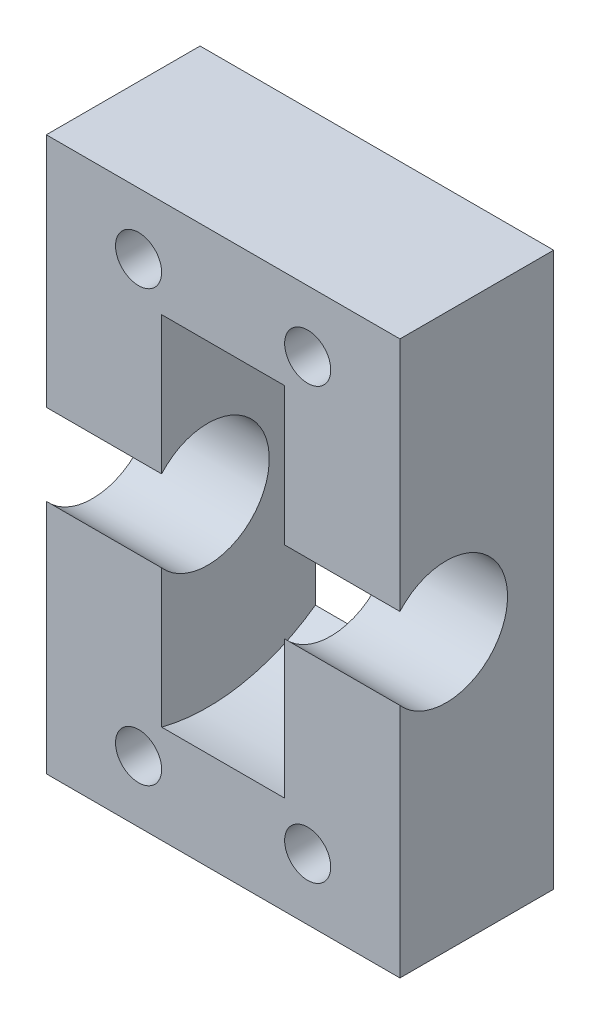
ISO-10303-21;
HEADER;
FILE_DESCRIPTION(('STEP AP214'),'2;1');
FILE_NAME('part.step','',(''),(''),'','','');
FILE_SCHEMA(('AUTOMOTIVE_DESIGN { 1 0 10303 214 1 1 1 1 }'));
ENDSEC;
DATA;
#1=APPLICATION_CONTEXT('core data for automotive mechanical design processes');
#2=APPLICATION_PROTOCOL_DEFINITION('international standard','automotive_design',2000,#1);
#3=PRODUCT_CONTEXT('',#1,'mechanical');
#4=PRODUCT('Part','Part','',(#3));
#5=PRODUCT_RELATED_PRODUCT_CATEGORY('part','',(#4));
#6=PRODUCT_DEFINITION_FORMATION('','',#4);
#7=PRODUCT_DEFINITION_CONTEXT('part definition',#1,'design');
#8=PRODUCT_DEFINITION('design','',#6,#7);
#9=PRODUCT_DEFINITION_SHAPE('','',#8);
#10=(LENGTH_UNIT() NAMED_UNIT(*) SI_UNIT(.MILLI.,.METRE.));
#11=(NAMED_UNIT(*) PLANE_ANGLE_UNIT() SI_UNIT($,.RADIAN.));
#12=(NAMED_UNIT(*) SI_UNIT($,.STERADIAN.) SOLID_ANGLE_UNIT());
#13=UNCERTAINTY_MEASURE_WITH_UNIT(LENGTH_MEASURE(1.E-05),#10,'distance_accuracy_value','');
#14=(GEOMETRIC_REPRESENTATION_CONTEXT(3) GLOBAL_UNCERTAINTY_ASSIGNED_CONTEXT((#13)) GLOBAL_UNIT_ASSIGNED_CONTEXT((#10,
#11,#12)) REPRESENTATION_CONTEXT('',''));
#15=CARTESIAN_POINT('',(0.,0.,0.));
#16=DIRECTION('',(0.,0.,1.));
#17=DIRECTION('',(1.,0.,0.));
#18=AXIS2_PLACEMENT_3D('',#15,#16,#17);
#19=CARTESIAN_POINT('',(23.,17.9999999999999,7.));
#20=DIRECTION('',(-1.,0.,0.));
#21=DIRECTION('',(0.,0.,1.));
#22=AXIS2_PLACEMENT_3D('',#19,#20,#21);
#23=CYLINDRICAL_SURFACE('',#22,4.);
#24=DIRECTION('',(-1.,0.,0.));
#25=VECTOR('',#24,1.);
#26=CARTESIAN_POINT('',(0.,20.6457513110646,9.99999999999999));
#27=LINE('',#26,#25);
#28=CARTESIAN_POINT('',(7.50000000000001,20.6457513110645,9.99999999999999));
#29=VERTEX_POINT('',#28);
#30=CARTESIAN_POINT('',(0.,20.6457513110645,9.99999999999999));
#31=VERTEX_POINT('',#30);
#32=EDGE_CURVE('E140',#29,#31,#27,.T.);
#33=ORIENTED_EDGE('',*,*,#32,.T.);
#34=CARTESIAN_POINT('',(0.,17.9999999999999,7.));
#35=DIRECTION('',(-1.,0.,0.));
#36=DIRECTION('',(0.,0.,1.));
#37=AXIS2_PLACEMENT_3D('',#34,#35,#36);
#38=CIRCLE('',#37,4.);
#39=CARTESIAN_POINT('',(0.,15.3542486889353,9.99999999999999));
#40=VERTEX_POINT('',#39);
#41=EDGE_CURVE('E199',#31,#40,#38,.T.);
#42=ORIENTED_EDGE('',*,*,#41,.T.);
#43=DIRECTION('',(-1.,0.,0.));
#44=VECTOR('',#43,1.);
#45=CARTESIAN_POINT('',(0.,15.3542486889353,9.99999999999999));
#46=LINE('',#45,#44);
#47=CARTESIAN_POINT('',(7.50000000000001,15.3542486889353,9.99999999999999));
#48=VERTEX_POINT('',#47);
#49=EDGE_CURVE('E123',#40,#48,#46,.F.);
#50=ORIENTED_EDGE('',*,*,#49,.T.);
#51=CARTESIAN_POINT('',(7.50000000000001,17.9999999999999,7.));
#52=DIRECTION('',(-1.,0.,0.));
#53=DIRECTION('',(0.,0.,1.));
#54=AXIS2_PLACEMENT_3D('',#51,#52,#53);
#55=CIRCLE('',#54,4.);
#56=EDGE_CURVE('E205',#29,#48,#55,.T.);
#57=ORIENTED_EDGE('',*,*,#56,.F.);
#58=EDGE_LOOP('',(#33,#42,#50,#57));
#59=FACE_BOUND('',#58,.T.);
#60=ADVANCED_FACE('F16',(#59),#23,.F.);
#61=CARTESIAN_POINT('',(23.,17.9999999999999,7.));
#62=DIRECTION('',(-1.,0.,0.));
#63=DIRECTION('',(0.,0.,1.));
#64=AXIS2_PLACEMENT_3D('',#61,#62,#63);
#65=CYLINDRICAL_SURFACE('',#64,4.);
#66=CARTESIAN_POINT('',(15.5,17.9999999999999,7.));
#67=DIRECTION('',(-1.,0.,0.));
#68=DIRECTION('',(0.,0.,1.));
#69=AXIS2_PLACEMENT_3D('',#66,#67,#68);
#70=CIRCLE('',#69,4.);
#71=CARTESIAN_POINT('',(15.5,20.6457513110645,9.99999999999999));
#72=VERTEX_POINT('',#71);
#73=CARTESIAN_POINT('',(15.5,15.3542486889353,9.99999999999999));
#74=VERTEX_POINT('',#73);
#75=EDGE_CURVE('E106',#72,#74,#70,.T.);
#76=ORIENTED_EDGE('',*,*,#75,.T.);
#77=DIRECTION('',(-1.,0.,0.));
#78=VECTOR('',#77,1.);
#79=CARTESIAN_POINT('',(0.,15.3542486889353,9.99999999999999));
#80=LINE('',#79,#78);
#81=CARTESIAN_POINT('',(23.,15.3542486889353,9.99999999999999));
#82=VERTEX_POINT('',#81);
#83=EDGE_CURVE('E109',#74,#82,#80,.F.);
#84=ORIENTED_EDGE('',*,*,#83,.T.);
#85=CARTESIAN_POINT('',(23.,17.9999999999999,7.));
#86=DIRECTION('',(-1.,0.,0.));
#87=DIRECTION('',(0.,0.,1.));
#88=AXIS2_PLACEMENT_3D('',#85,#86,#87);
#89=CIRCLE('',#88,4.);
#90=CARTESIAN_POINT('',(23.,20.6457513110645,9.99999999999999));
#91=VERTEX_POINT('',#90);
#92=EDGE_CURVE('E197',#82,#91,#89,.F.);
#93=ORIENTED_EDGE('',*,*,#92,.T.);
#94=DIRECTION('',(-1.,0.,0.));
#95=VECTOR('',#94,1.);
#96=CARTESIAN_POINT('',(0.,20.6457513110645,9.99999999999999));
#97=LINE('',#96,#95);
#98=EDGE_CURVE('E103',#91,#72,#97,.T.);
#99=ORIENTED_EDGE('',*,*,#98,.T.);
#100=EDGE_LOOP('',(#76,#84,#93,#99));
#101=FACE_BOUND('',#100,.T.);
#102=ADVANCED_FACE('F108',(#101),#65,.F.);
#103=CARTESIAN_POINT('',(0.,35.9999999999999,9.99999999999999));
#104=DIRECTION('',(0.,0.,-1.));
#105=DIRECTION('',(-1.,0.,0.));
#106=AXIS2_PLACEMENT_3D('',#103,#104,#105);
#107=PLANE('',#106);
#108=DIRECTION('',(0.,1.,0.));
#109=VECTOR('',#108,1.);
#110=CARTESIAN_POINT('',(15.5,17.9999999999998,10.));
#111=LINE('',#110,#109);
#112=CARTESIAN_POINT('',(15.5000000000001,29.618950038622,9.99999999999999));
#113=VERTEX_POINT('',#112);
#114=EDGE_CURVE('E114',#113,#72,#111,.F.);
#115=ORIENTED_EDGE('',*,*,#114,.T.);
#116=ORIENTED_EDGE('',*,*,#98,.F.);
#117=DIRECTION('',(0.,1.,0.));
#118=VECTOR('',#117,1.);
#119=CARTESIAN_POINT('',(23.,0.,9.99999999999999));
#120=LINE('',#119,#118);
#121=CARTESIAN_POINT('',(23.,35.9999999999999,10.));
#122=VERTEX_POINT('',#121);
#123=EDGE_CURVE('E176',#91,#122,#120,.T.);
#124=ORIENTED_EDGE('',*,*,#123,.T.);
#125=DIRECTION('',(1.,0.,0.));
#126=VECTOR('',#125,1.);
#127=CARTESIAN_POINT('',(0.,35.9999999999999,10.));
#128=LINE('',#127,#126);
#129=CARTESIAN_POINT('',(0.,35.9999999999999,9.99999999999999));
#130=VERTEX_POINT('',#129);
#131=EDGE_CURVE('E155',#122,#130,#128,.F.);
#132=ORIENTED_EDGE('',*,*,#131,.T.);
#133=DIRECTION('',(0.,1.,0.));
#134=VECTOR('',#133,1.);
#135=CARTESIAN_POINT('',(0.,0.,9.99999999999999));
#136=LINE('',#135,#134);
#137=EDGE_CURVE('E182',#130,#31,#136,.F.);
#138=ORIENTED_EDGE('',*,*,#137,.T.);
#139=ORIENTED_EDGE('',*,*,#32,.F.);
#140=DIRECTION('',(0.,1.,0.));
#141=VECTOR('',#140,1.);
#142=CARTESIAN_POINT('',(7.50000000000001,17.9999999999999,10.));
#143=LINE('',#142,#141);
#144=CARTESIAN_POINT('',(7.50000000000001,29.618950038622,9.99999999999997));
#145=VERTEX_POINT('',#144);
#146=EDGE_CURVE('E208',#145,#29,#143,.F.);
#147=ORIENTED_EDGE('',*,*,#146,.F.);
#148=DIRECTION('',(-1.,0.,0.));
#149=VECTOR('',#148,1.);
#150=CARTESIAN_POINT('',(15.5,29.618950038622,9.99999999999994));
#151=LINE('',#150,#149);
#152=EDGE_CURVE('E131',#145,#113,#151,.F.);
#153=ORIENTED_EDGE('',*,*,#152,.T.);
#154=EDGE_LOOP('',(#115,#116,#124,#132,#138,#139,#147,#153));
#155=FACE_BOUND('',#154,.T.);
#156=CARTESIAN_POINT('',(5.99999999999998,32.,10.));
#157=DIRECTION('',(0.,0.,1.));
#158=DIRECTION('',(1.,0.,0.));
#159=AXIS2_PLACEMENT_3D('',#156,#157,#158);
#160=CIRCLE('',#159,1.5);
#161=CARTESIAN_POINT('',(7.49999999999998,32.,10.));
#162=VERTEX_POINT('',#161);
#163=EDGE_CURVE('E138',#162,#162,#160,.F.);
#164=ORIENTED_EDGE('',*,*,#163,.T.);
#165=EDGE_LOOP('',(#164));
#166=FACE_BOUND('',#165,.T.);
#167=CARTESIAN_POINT('',(17.,32.,10.));
#168=DIRECTION('',(0.,0.,1.));
#169=DIRECTION('',(1.,0.,0.));
#170=AXIS2_PLACEMENT_3D('',#167,#168,#169);
#171=CIRCLE('',#170,1.5);
#172=CARTESIAN_POINT('',(18.5,32.,10.));
#173=VERTEX_POINT('',#172);
#174=EDGE_CURVE('E213',#173,#173,#171,.F.);
#175=ORIENTED_EDGE('',*,*,#174,.T.);
#176=EDGE_LOOP('',(#175));
#177=FACE_BOUND('',#176,.T.);
#178=ADVANCED_FACE('F280',(#155,#166,#177),#107,.F.);
#179=CARTESIAN_POINT('',(0.,35.9999999999999,9.99999999999999));
#180=DIRECTION('',(0.,0.,-1.));
#181=DIRECTION('',(-1.,0.,0.));
#182=AXIS2_PLACEMENT_3D('',#179,#180,#181);
#183=PLANE('',#182);
#184=DIRECTION('',(0.,1.,0.));
#185=VECTOR('',#184,1.);
#186=CARTESIAN_POINT('',(15.5,17.9999999999998,9.99999999999999));
#187=LINE('',#186,#185);
#188=CARTESIAN_POINT('',(15.5,6.38104996137751,10.));
#189=VERTEX_POINT('',#188);
#190=EDGE_CURVE('E113',#74,#189,#187,.F.);
#191=ORIENTED_EDGE('',*,*,#190,.T.);
#192=DIRECTION('',(-1.,0.,0.));
#193=VECTOR('',#192,1.);
#194=CARTESIAN_POINT('',(15.5,6.38104996137752,10.));
#195=LINE('',#194,#193);
#196=CARTESIAN_POINT('',(7.50000000000001,6.38104996137751,10.));
#197=VERTEX_POINT('',#196);
#198=EDGE_CURVE('E180',#189,#197,#195,.T.);
#199=ORIENTED_EDGE('',*,*,#198,.T.);
#200=DIRECTION('',(0.,1.,0.));
#201=VECTOR('',#200,1.);
#202=CARTESIAN_POINT('',(7.50000000000001,17.9999999999999,9.99999999999999));
#203=LINE('',#202,#201);
#204=EDGE_CURVE('E204',#48,#197,#203,.F.);
#205=ORIENTED_EDGE('',*,*,#204,.F.);
#206=ORIENTED_EDGE('',*,*,#49,.F.);
#207=DIRECTION('',(0.,1.,0.));
#208=VECTOR('',#207,1.);
#209=CARTESIAN_POINT('',(0.,0.,10.));
#210=LINE('',#209,#208);
#211=CARTESIAN_POINT('',(0.,0.,10.));
#212=VERTEX_POINT('',#211);
#213=EDGE_CURVE('E157',#40,#212,#210,.F.);
#214=ORIENTED_EDGE('',*,*,#213,.T.);
#215=DIRECTION('',(-1.,0.,0.));
#216=VECTOR('',#215,1.);
#217=CARTESIAN_POINT('',(0.,0.,10.));
#218=LINE('',#217,#216);
#219=CARTESIAN_POINT('',(23.,0.,10.));
#220=VERTEX_POINT('',#219);
#221=EDGE_CURVE('E146',#212,#220,#218,.F.);
#222=ORIENTED_EDGE('',*,*,#221,.T.);
#223=DIRECTION('',(0.,1.,0.));
#224=VECTOR('',#223,1.);
#225=CARTESIAN_POINT('',(23.,0.,10.));
#226=LINE('',#225,#224);
#227=EDGE_CURVE('E121',#220,#82,#226,.T.);
#228=ORIENTED_EDGE('',*,*,#227,.T.);
#229=ORIENTED_EDGE('',*,*,#83,.F.);
#230=EDGE_LOOP('',(#191,#199,#205,#206,#214,#222,#228,#229));
#231=FACE_BOUND('',#230,.T.);
#232=CARTESIAN_POINT('',(17.,4.,10.));
#233=DIRECTION('',(0.,0.,1.));
#234=DIRECTION('',(1.,0.,0.));
#235=AXIS2_PLACEMENT_3D('',#232,#233,#234);
#236=CIRCLE('',#235,1.5);
#237=CARTESIAN_POINT('',(18.5,4.,10.));
#238=VERTEX_POINT('',#237);
#239=EDGE_CURVE('E215',#238,#238,#236,.F.);
#240=ORIENTED_EDGE('',*,*,#239,.T.);
#241=EDGE_LOOP('',(#240));
#242=FACE_BOUND('',#241,.T.);
#243=CARTESIAN_POINT('',(6.00000000000001,4.,10.));
#244=DIRECTION('',(0.,0.,1.));
#245=DIRECTION('',(1.,0.,0.));
#246=AXIS2_PLACEMENT_3D('',#243,#244,#245);
#247=CIRCLE('',#246,1.5);
#248=CARTESIAN_POINT('',(7.50000000000001,4.,10.));
#249=VERTEX_POINT('',#248);
#250=EDGE_CURVE('E19',#249,#249,#247,.F.);
#251=ORIENTED_EDGE('',*,*,#250,.T.);
#252=EDGE_LOOP('',(#251));
#253=FACE_BOUND('',#252,.T.);
#254=ADVANCED_FACE('F117',(#231,#242,#253),#183,.F.);
#255=CARTESIAN_POINT('',(6.00000000000001,4.,0.));
#256=DIRECTION('',(0.,0.,1.));
#257=DIRECTION('',(1.,0.,0.));
#258=AXIS2_PLACEMENT_3D('',#255,#256,#257);
#259=CYLINDRICAL_SURFACE('',#258,1.5);
#260=ORIENTED_EDGE('',*,*,#250,.F.);
#261=EDGE_LOOP('',(#260));
#262=FACE_BOUND('',#261,.T.);
#263=CARTESIAN_POINT('',(6.00000000000001,4.,0.));
#264=DIRECTION('',(0.,0.,1.));
#265=DIRECTION('',(1.,0.,0.));
#266=AXIS2_PLACEMENT_3D('',#263,#264,#265);
#267=CIRCLE('',#266,1.5);
#268=CARTESIAN_POINT('',(7.50000000000001,4.,0.));
#269=VERTEX_POINT('',#268);
#270=EDGE_CURVE('E152',#269,#269,#267,.T.);
#271=ORIENTED_EDGE('',*,*,#270,.F.);
#272=EDGE_LOOP('',(#271));
#273=FACE_BOUND('',#272,.T.);
#274=ADVANCED_FACE('F222',(#262,#273),#259,.F.);
#275=CARTESIAN_POINT('',(17.,4.,0.));
#276=DIRECTION('',(0.,0.,1.));
#277=DIRECTION('',(1.,0.,0.));
#278=AXIS2_PLACEMENT_3D('',#275,#276,#277);
#279=CYLINDRICAL_SURFACE('',#278,1.5);
#280=ORIENTED_EDGE('',*,*,#239,.F.);
#281=EDGE_LOOP('',(#280));
#282=FACE_BOUND('',#281,.T.);
#283=CARTESIAN_POINT('',(17.,4.,0.));
#284=DIRECTION('',(0.,0.,1.));
#285=DIRECTION('',(1.,0.,0.));
#286=AXIS2_PLACEMENT_3D('',#283,#284,#285);
#287=CIRCLE('',#286,1.5);
#288=CARTESIAN_POINT('',(18.5,4.,0.));
#289=VERTEX_POINT('',#288);
#290=EDGE_CURVE('E192',#289,#289,#287,.T.);
#291=ORIENTED_EDGE('',*,*,#290,.F.);
#292=EDGE_LOOP('',(#291));
#293=FACE_BOUND('',#292,.T.);
#294=ADVANCED_FACE('F225',(#282,#293),#279,.F.);
#295=CARTESIAN_POINT('',(17.,32.,0.));
#296=DIRECTION('',(0.,0.,1.));
#297=DIRECTION('',(1.,0.,0.));
#298=AXIS2_PLACEMENT_3D('',#295,#296,#297);
#299=CYLINDRICAL_SURFACE('',#298,1.5);
#300=ORIENTED_EDGE('',*,*,#174,.F.);
#301=EDGE_LOOP('',(#300));
#302=FACE_BOUND('',#301,.T.);
#303=CARTESIAN_POINT('',(17.,32.,0.));
#304=DIRECTION('',(0.,0.,1.));
#305=DIRECTION('',(1.,0.,0.));
#306=AXIS2_PLACEMENT_3D('',#303,#304,#305);
#307=CIRCLE('',#306,1.5);
#308=CARTESIAN_POINT('',(18.5,32.,0.));
#309=VERTEX_POINT('',#308);
#310=EDGE_CURVE('E189',#309,#309,#307,.T.);
#311=ORIENTED_EDGE('',*,*,#310,.F.);
#312=EDGE_LOOP('',(#311));
#313=FACE_BOUND('',#312,.T.);
#314=ADVANCED_FACE('F270',(#302,#313),#299,.F.);
#315=CARTESIAN_POINT('',(5.99999999999998,32.,0.));
#316=DIRECTION('',(0.,0.,1.));
#317=DIRECTION('',(1.,0.,0.));
#318=AXIS2_PLACEMENT_3D('',#315,#316,#317);
#319=CYLINDRICAL_SURFACE('',#318,1.5);
#320=ORIENTED_EDGE('',*,*,#163,.F.);
#321=EDGE_LOOP('',(#320));
#322=FACE_BOUND('',#321,.T.);
#323=CARTESIAN_POINT('',(5.99999999999998,32.,0.));
#324=DIRECTION('',(0.,0.,1.));
#325=DIRECTION('',(1.,0.,0.));
#326=AXIS2_PLACEMENT_3D('',#323,#324,#325);
#327=CIRCLE('',#326,1.5);
#328=CARTESIAN_POINT('',(7.49999999999998,32.,0.));
#329=VERTEX_POINT('',#328);
#330=EDGE_CURVE('E186',#329,#329,#327,.T.);
#331=ORIENTED_EDGE('',*,*,#330,.F.);
#332=EDGE_LOOP('',(#331));
#333=FACE_BOUND('',#332,.T.);
#334=ADVANCED_FACE('F267',(#322,#333),#319,.F.);
#335=CARTESIAN_POINT('',(15.5,17.9999999999998,7.));
#336=DIRECTION('',(1.,0.,0.));
#337=DIRECTION('',(0.,0.,-1.));
#338=AXIS2_PLACEMENT_3D('',#335,#336,#337);
#339=PLANE('',#338);
#340=CARTESIAN_POINT('',(15.5,17.9999999999998,7.));
#341=DIRECTION('',(-1.,0.,0.));
#342=DIRECTION('',(0.,0.,1.));
#343=AXIS2_PLACEMENT_3D('',#340,#341,#342);
#344=CIRCLE('',#343,12.);
#345=CARTESIAN_POINT('',(15.5,8.25320565519091,0.));
#346=VERTEX_POINT('',#345);
#347=EDGE_CURVE('E127',#346,#189,#344,.T.);
#348=ORIENTED_EDGE('',*,*,#347,.T.);
#349=ORIENTED_EDGE('',*,*,#190,.F.);
#350=ORIENTED_EDGE('',*,*,#75,.F.);
#351=ORIENTED_EDGE('',*,*,#114,.F.);
#352=CARTESIAN_POINT('',(15.5000000000002,17.9999999999998,7.));
#353=DIRECTION('',(-1.,0.,0.));
#354=DIRECTION('',(0.,0.,1.));
#355=AXIS2_PLACEMENT_3D('',#352,#353,#354);
#356=CIRCLE('',#355,12.);
#357=CARTESIAN_POINT('',(15.5000000000001,27.7467943448088,0.));
#358=VERTEX_POINT('',#357);
#359=EDGE_CURVE('E129',#113,#358,#356,.T.);
#360=ORIENTED_EDGE('',*,*,#359,.T.);
#361=DIRECTION('',(0.,1.,0.));
#362=VECTOR('',#361,1.);
#363=CARTESIAN_POINT('',(15.5,35.9999999999999,0.));
#364=LINE('',#363,#362);
#365=EDGE_CURVE('E135',#346,#358,#364,.T.);
#366=ORIENTED_EDGE('',*,*,#365,.F.);
#367=EDGE_LOOP('',(#348,#349,#350,#351,#360,#366));
#368=FACE_BOUND('',#367,.T.);
#369=ADVANCED_FACE('F125',(#368),#339,.F.);
#370=CARTESIAN_POINT('',(15.5,17.9999999999998,7.));
#371=DIRECTION('',(-1.,0.,0.));
#372=DIRECTION('',(0.,0.,1.));
#373=AXIS2_PLACEMENT_3D('',#370,#371,#372);
#374=CYLINDRICAL_SURFACE('',#373,12.);
#375=CARTESIAN_POINT('',(7.50000000000001,17.9999999999998,7.));
#376=DIRECTION('',(-1.,0.,0.));
#377=DIRECTION('',(0.,0.,1.));
#378=AXIS2_PLACEMENT_3D('',#375,#376,#377);
#379=CIRCLE('',#378,12.);
#380=CARTESIAN_POINT('',(7.50000000000001,27.7467943448088,0.));
#381=VERTEX_POINT('',#380);
#382=EDGE_CURVE('E185',#381,#145,#379,.F.);
#383=ORIENTED_EDGE('',*,*,#382,.F.);
#384=DIRECTION('',(-1.,0.,0.));
#385=VECTOR('',#384,1.);
#386=CARTESIAN_POINT('',(0.,27.7467943448088,0.));
#387=LINE('',#386,#385);
#388=EDGE_CURVE('E316',#358,#381,#387,.T.);
#389=ORIENTED_EDGE('',*,*,#388,.F.);
#390=ORIENTED_EDGE('',*,*,#359,.F.);
#391=ORIENTED_EDGE('',*,*,#152,.F.);
#392=EDGE_LOOP('',(#383,#389,#390,#391));
#393=FACE_BOUND('',#392,.T.);
#394=ADVANCED_FACE('F260',(#393),#374,.F.);
#395=CARTESIAN_POINT('',(7.50000000000001,17.9999999999999,7.00000000000001));
#396=DIRECTION('',(1.,0.,0.));
#397=DIRECTION('',(0.,0.,-1.));
#398=AXIS2_PLACEMENT_3D('',#395,#396,#397);
#399=PLANE('',#398);
#400=CARTESIAN_POINT('',(7.50000000000001,17.9999999999998,7.));
#401=DIRECTION('',(-1.,0.,0.));
#402=DIRECTION('',(0.,0.,1.));
#403=AXIS2_PLACEMENT_3D('',#400,#401,#402);
#404=CIRCLE('',#403,12.);
#405=CARTESIAN_POINT('',(7.50000000000001,8.25320565519091,0.));
#406=VERTEX_POINT('',#405);
#407=EDGE_CURVE('E202',#197,#406,#404,.F.);
#408=ORIENTED_EDGE('',*,*,#407,.T.);
#409=DIRECTION('',(0.,1.,0.));
#410=VECTOR('',#409,1.);
#411=CARTESIAN_POINT('',(7.50000000000001,35.9999999999999,0.));
#412=LINE('',#411,#410);
#413=EDGE_CURVE('E319',#381,#406,#412,.F.);
#414=ORIENTED_EDGE('',*,*,#413,.F.);
#415=ORIENTED_EDGE('',*,*,#382,.T.);
#416=ORIENTED_EDGE('',*,*,#146,.T.);
#417=ORIENTED_EDGE('',*,*,#56,.T.);
#418=ORIENTED_EDGE('',*,*,#204,.T.);
#419=EDGE_LOOP('',(#408,#414,#415,#416,#417,#418));
#420=FACE_BOUND('',#419,.T.);
#421=ADVANCED_FACE('F256',(#420),#399,.T.);
#422=CARTESIAN_POINT('',(15.5,17.9999999999998,7.));
#423=DIRECTION('',(-1.,0.,0.));
#424=DIRECTION('',(0.,0.,1.));
#425=AXIS2_PLACEMENT_3D('',#422,#423,#424);
#426=CYLINDRICAL_SURFACE('',#425,12.);
#427=ORIENTED_EDGE('',*,*,#347,.F.);
#428=DIRECTION('',(-1.,0.,0.));
#429=VECTOR('',#428,1.);
#430=CARTESIAN_POINT('',(0.,8.25320565519103,0.));
#431=LINE('',#430,#429);
#432=EDGE_CURVE('E321',#406,#346,#431,.F.);
#433=ORIENTED_EDGE('',*,*,#432,.F.);
#434=ORIENTED_EDGE('',*,*,#407,.F.);
#435=ORIENTED_EDGE('',*,*,#198,.F.);
#436=EDGE_LOOP('',(#427,#433,#434,#435));
#437=FACE_BOUND('',#436,.T.);
#438=ADVANCED_FACE('F252',(#437),#426,.F.);
#439=CARTESIAN_POINT('',(0.,0.,10.));
#440=DIRECTION('',(1.,0.,0.));
#441=DIRECTION('',(0.,0.,-1.));
#442=AXIS2_PLACEMENT_3D('',#439,#440,#441);
#443=PLANE('',#442);
#444=ORIENTED_EDGE('',*,*,#41,.F.);
#445=ORIENTED_EDGE('',*,*,#137,.F.);
#446=DIRECTION('',(0.,0.,1.));
#447=VECTOR('',#446,1.);
#448=CARTESIAN_POINT('',(0.,35.9999999999999,9.99999999999999));
#449=LINE('',#448,#447);
#450=CARTESIAN_POINT('',(0.,35.9999999999999,0.));
#451=VERTEX_POINT('',#450);
#452=EDGE_CURVE('E143',#130,#451,#449,.F.);
#453=ORIENTED_EDGE('',*,*,#452,.T.);
#454=DIRECTION('',(0.,1.,0.));
#455=VECTOR('',#454,1.);
#456=CARTESIAN_POINT('',(0.,35.9999999999999,0.));
#457=LINE('',#456,#455);
#458=CARTESIAN_POINT('',(0.,0.,0.));
#459=VERTEX_POINT('',#458);
#460=EDGE_CURVE('E167',#459,#451,#457,.T.);
#461=ORIENTED_EDGE('',*,*,#460,.F.);
#462=DIRECTION('',(0.,0.,1.));
#463=VECTOR('',#462,1.);
#464=CARTESIAN_POINT('',(0.,0.,10.));
#465=LINE('',#464,#463);
#466=EDGE_CURVE('E148',#459,#212,#465,.T.);
#467=ORIENTED_EDGE('',*,*,#466,.T.);
#468=ORIENTED_EDGE('',*,*,#213,.F.);
#469=EDGE_LOOP('',(#444,#445,#453,#461,#467,#468));
#470=FACE_BOUND('',#469,.T.);
#471=ADVANCED_FACE('F248',(#470),#443,.F.);
#472=CARTESIAN_POINT('',(0.,35.9999999999999,9.99999999999999));
#473=DIRECTION('',(0.,-1.,0.));
#474=DIRECTION('',(1.,0.,0.));
#475=AXIS2_PLACEMENT_3D('',#472,#473,#474);
#476=PLANE('',#475);
#477=ORIENTED_EDGE('',*,*,#452,.F.);
#478=ORIENTED_EDGE('',*,*,#131,.F.);
#479=DIRECTION('',(0.,0.,1.));
#480=VECTOR('',#479,1.);
#481=CARTESIAN_POINT('',(23.,35.9999999999999,10.));
#482=LINE('',#481,#480);
#483=CARTESIAN_POINT('',(23.,35.9999999999999,0.));
#484=VERTEX_POINT('',#483);
#485=EDGE_CURVE('E141',#122,#484,#482,.F.);
#486=ORIENTED_EDGE('',*,*,#485,.T.);
#487=DIRECTION('',(-1.,0.,0.));
#488=VECTOR('',#487,1.);
#489=CARTESIAN_POINT('',(0.,35.9999999999999,0.));
#490=LINE('',#489,#488);
#491=EDGE_CURVE('E162',#451,#484,#490,.F.);
#492=ORIENTED_EDGE('',*,*,#491,.F.);
#493=EDGE_LOOP('',(#477,#478,#486,#492));
#494=FACE_BOUND('',#493,.T.);
#495=ADVANCED_FACE('F245',(#494),#476,.F.);
#496=CARTESIAN_POINT('',(23.,0.,10.));
#497=DIRECTION('',(-1.,0.,0.));
#498=DIRECTION('',(0.,0.,1.));
#499=AXIS2_PLACEMENT_3D('',#496,#497,#498);
#500=PLANE('',#499);
#501=ORIENTED_EDGE('',*,*,#92,.F.);
#502=ORIENTED_EDGE('',*,*,#227,.F.);
#503=DIRECTION('',(0.,0.,1.));
#504=VECTOR('',#503,1.);
#505=CARTESIAN_POINT('',(23.,0.,10.));
#506=LINE('',#505,#504);
#507=CARTESIAN_POINT('',(23.,0.,0.));
#508=VERTEX_POINT('',#507);
#509=EDGE_CURVE('E34',#220,#508,#506,.F.);
#510=ORIENTED_EDGE('',*,*,#509,.T.);
#511=DIRECTION('',(0.,1.,0.));
#512=VECTOR('',#511,1.);
#513=CARTESIAN_POINT('',(23.,35.9999999999999,0.));
#514=LINE('',#513,#512);
#515=EDGE_CURVE('E25',#484,#508,#514,.F.);
#516=ORIENTED_EDGE('',*,*,#515,.F.);
#517=ORIENTED_EDGE('',*,*,#485,.F.);
#518=ORIENTED_EDGE('',*,*,#123,.F.);
#519=EDGE_LOOP('',(#501,#502,#510,#516,#517,#518));
#520=FACE_BOUND('',#519,.T.);
#521=ADVANCED_FACE('F238',(#520),#500,.F.);
#522=CARTESIAN_POINT('',(0.,0.,10.));
#523=DIRECTION('',(0.,1.,0.));
#524=DIRECTION('',(-1.,0.,0.));
#525=AXIS2_PLACEMENT_3D('',#522,#523,#524);
#526=PLANE('',#525);
#527=ORIENTED_EDGE('',*,*,#509,.F.);
#528=ORIENTED_EDGE('',*,*,#221,.F.);
#529=ORIENTED_EDGE('',*,*,#466,.F.);
#530=DIRECTION('',(-1.,0.,0.));
#531=VECTOR('',#530,1.);
#532=CARTESIAN_POINT('',(0.,0.,0.));
#533=LINE('',#532,#531);
#534=EDGE_CURVE('E11',#508,#459,#533,.T.);
#535=ORIENTED_EDGE('',*,*,#534,.F.);
#536=EDGE_LOOP('',(#527,#528,#529,#535));
#537=FACE_BOUND('',#536,.T.);
#538=ADVANCED_FACE('F231',(#537),#526,.F.);
#539=CARTESIAN_POINT('',(0.,35.9999999999999,0.));
#540=DIRECTION('',(0.,0.,-1.));
#541=DIRECTION('',(-1.,0.,0.));
#542=AXIS2_PLACEMENT_3D('',#539,#540,#541);
#543=PLANE('',#542);
#544=ORIENTED_EDGE('',*,*,#515,.T.);
#545=ORIENTED_EDGE('',*,*,#534,.T.);
#546=ORIENTED_EDGE('',*,*,#460,.T.);
#547=ORIENTED_EDGE('',*,*,#491,.T.);
#548=EDGE_LOOP('',(#544,#545,#546,#547));
#549=FACE_BOUND('',#548,.T.);
#550=ORIENTED_EDGE('',*,*,#413,.T.);
#551=ORIENTED_EDGE('',*,*,#432,.T.);
#552=ORIENTED_EDGE('',*,*,#365,.T.);
#553=ORIENTED_EDGE('',*,*,#388,.T.);
#554=EDGE_LOOP('',(#550,#551,#552,#553));
#555=FACE_BOUND('',#554,.T.);
#556=ORIENTED_EDGE('',*,*,#330,.T.);
#557=EDGE_LOOP('',(#556));
#558=FACE_BOUND('',#557,.T.);
#559=ORIENTED_EDGE('',*,*,#310,.T.);
#560=EDGE_LOOP('',(#559));
#561=FACE_BOUND('',#560,.T.);
#562=ORIENTED_EDGE('',*,*,#290,.T.);
#563=EDGE_LOOP('',(#562));
#564=FACE_BOUND('',#563,.T.);
#565=ORIENTED_EDGE('',*,*,#270,.T.);
#566=EDGE_LOOP('',(#565));
#567=FACE_BOUND('',#566,.T.);
#568=ADVANCED_FACE('F229',(#549,#555,#558,#561,#564,#567),#543,.T.);
#569=CLOSED_SHELL('',(#60,#102,#178,#254,#274,#294,#314,#334,#369,#394,#421,#438,#471,#495,#521,
#538,#568));
#570=MANIFOLD_SOLID_BREP('B1',#569);
#571=ADVANCED_BREP_SHAPE_REPRESENTATION('',(#18,#570),#14);
#572=SHAPE_DEFINITION_REPRESENTATION(#9,#571);
ENDSEC;
END-ISO-10303-21;
